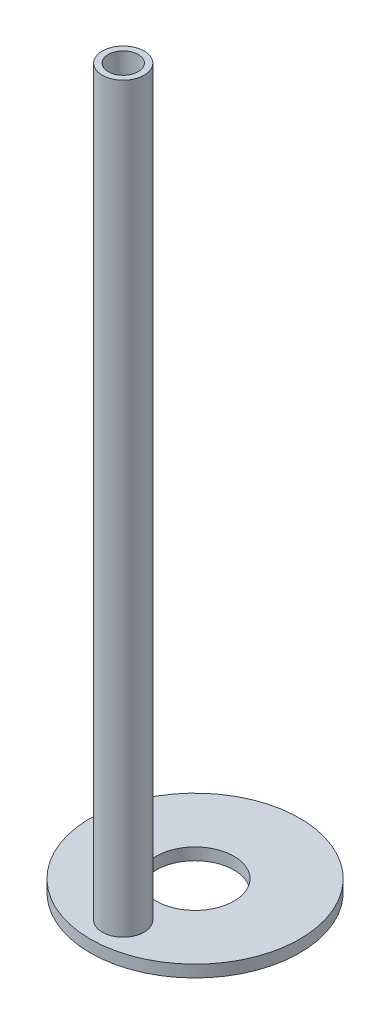
ISO-10303-21;
HEADER;
FILE_DESCRIPTION(('STEP AP214'),'2;1');
FILE_NAME('part.step','',(''),(''),'','','');
FILE_SCHEMA(('AUTOMOTIVE_DESIGN { 1 0 10303 214 1 1 1 1 }'));
ENDSEC;
DATA;
#1=APPLICATION_CONTEXT('core data for automotive mechanical design processes');
#2=APPLICATION_PROTOCOL_DEFINITION('international standard','automotive_design',2000,#1);
#3=PRODUCT_CONTEXT('',#1,'mechanical');
#4=PRODUCT('Part','Part','',(#3));
#5=PRODUCT_RELATED_PRODUCT_CATEGORY('part','',(#4));
#6=PRODUCT_DEFINITION_FORMATION('','',#4);
#7=PRODUCT_DEFINITION_CONTEXT('part definition',#1,'design');
#8=PRODUCT_DEFINITION('design','',#6,#7);
#9=PRODUCT_DEFINITION_SHAPE('','',#8);
#10=(LENGTH_UNIT() NAMED_UNIT(*) SI_UNIT(.MILLI.,.METRE.));
#11=(NAMED_UNIT(*) PLANE_ANGLE_UNIT() SI_UNIT($,.RADIAN.));
#12=(NAMED_UNIT(*) SI_UNIT($,.STERADIAN.) SOLID_ANGLE_UNIT());
#13=UNCERTAINTY_MEASURE_WITH_UNIT(LENGTH_MEASURE(1.E-05),#10,'distance_accuracy_value','');
#14=(GEOMETRIC_REPRESENTATION_CONTEXT(3) GLOBAL_UNCERTAINTY_ASSIGNED_CONTEXT((#13)) GLOBAL_UNIT_ASSIGNED_CONTEXT((#10,
#11,#12)) REPRESENTATION_CONTEXT('',''));
#15=CARTESIAN_POINT('',(0.,0.,0.));
#16=DIRECTION('',(0.,0.,1.));
#17=DIRECTION('',(1.,0.,0.));
#18=AXIS2_PLACEMENT_3D('',#15,#16,#17);
#19=CARTESIAN_POINT('',(0.,1.,0.));
#20=DIRECTION('',(0.,-1.,0.));
#21=DIRECTION('',(0.,0.,-1.));
#22=AXIS2_PLACEMENT_3D('',#19,#20,#21);
#23=CYLINDRICAL_SURFACE('',#22,6.5);
#24=CARTESIAN_POINT('',(0.,1.,0.));
#25=DIRECTION('',(0.,1.,0.));
#26=DIRECTION('',(0.,0.,1.));
#27=AXIS2_PLACEMENT_3D('',#24,#25,#26);
#28=CIRCLE('',#27,6.5);
#29=CARTESIAN_POINT('',(0.,1.,6.5));
#30=VERTEX_POINT('',#29);
#31=EDGE_CURVE('E53',#30,#30,#28,.T.);
#32=ORIENTED_EDGE('',*,*,#31,.T.);
#33=EDGE_LOOP('',(#32));
#34=FACE_BOUND('',#33,.T.);
#35=CARTESIAN_POINT('',(0.,-1.,0.));
#36=DIRECTION('',(0.,1.,0.));
#37=DIRECTION('',(0.,0.,1.));
#38=AXIS2_PLACEMENT_3D('',#35,#36,#37);
#39=CIRCLE('',#38,6.5);
#40=CARTESIAN_POINT('',(0.,-1.,6.5));
#41=VERTEX_POINT('',#40);
#42=EDGE_CURVE('E63',#41,#41,#39,.T.);
#43=ORIENTED_EDGE('',*,*,#42,.F.);
#44=EDGE_LOOP('',(#43));
#45=FACE_BOUND('',#44,.T.);
#46=ADVANCED_FACE('F45',(#34,#45),#23,.F.);
#47=CARTESIAN_POINT('',(0.,1.,0.));
#48=DIRECTION('',(0.,-1.,0.));
#49=DIRECTION('',(0.,0.,-1.));
#50=AXIS2_PLACEMENT_3D('',#47,#48,#49);
#51=CYLINDRICAL_SURFACE('',#50,17.5);
#52=CARTESIAN_POINT('',(0.,1.,0.));
#53=DIRECTION('',(0.,1.,0.));
#54=DIRECTION('',(0.,0.,1.));
#55=AXIS2_PLACEMENT_3D('',#52,#53,#54);
#56=CIRCLE('',#55,17.5);
#57=CARTESIAN_POINT('',(0.,1.,17.5));
#58=VERTEX_POINT('',#57);
#59=EDGE_CURVE('E10',#58,#58,#56,.T.);
#60=ORIENTED_EDGE('',*,*,#59,.F.);
#61=EDGE_LOOP('',(#60));
#62=FACE_BOUND('',#61,.T.);
#63=CARTESIAN_POINT('',(0.,-1.,0.));
#64=DIRECTION('',(0.,1.,0.));
#65=DIRECTION('',(0.,0.,1.));
#66=AXIS2_PLACEMENT_3D('',#63,#64,#65);
#67=CIRCLE('',#66,17.5);
#68=CARTESIAN_POINT('',(0.,-1.,17.5));
#69=VERTEX_POINT('',#68);
#70=EDGE_CURVE('E59',#69,#69,#67,.T.);
#71=ORIENTED_EDGE('',*,*,#70,.T.);
#72=EDGE_LOOP('',(#71));
#73=FACE_BOUND('',#72,.T.);
#74=ADVANCED_FACE('F70',(#62,#73),#51,.T.);
#75=CARTESIAN_POINT('',(0.,1.,0.));
#76=DIRECTION('',(0.,1.,0.));
#77=DIRECTION('',(0.,0.,1.));
#78=AXIS2_PLACEMENT_3D('',#75,#76,#77);
#79=PLANE('',#78);
#80=CARTESIAN_POINT('',(0.,1.,12.));
#81=DIRECTION('',(0.,1.,0.));
#82=DIRECTION('',(0.,0.,1.));
#83=AXIS2_PLACEMENT_3D('',#80,#81,#82);
#84=CIRCLE('',#83,3.5);
#85=CARTESIAN_POINT('',(0.,1.,15.5));
#86=VERTEX_POINT('',#85);
#87=EDGE_CURVE('E48',#86,#86,#84,.F.);
#88=ORIENTED_EDGE('',*,*,#87,.T.);
#89=EDGE_LOOP('',(#88));
#90=FACE_BOUND('',#89,.T.);
#91=ORIENTED_EDGE('',*,*,#31,.F.);
#92=EDGE_LOOP('',(#91));
#93=FACE_BOUND('',#92,.T.);
#94=ORIENTED_EDGE('',*,*,#59,.T.);
#95=EDGE_LOOP('',(#94));
#96=FACE_BOUND('',#95,.T.);
#97=ADVANCED_FACE('F75',(#90,#93,#96),#79,.T.);
#98=CARTESIAN_POINT('',(0.,-1.,0.));
#99=DIRECTION('',(0.,1.,0.));
#100=DIRECTION('',(0.,0.,1.));
#101=AXIS2_PLACEMENT_3D('',#98,#99,#100);
#102=PLANE('',#101);
#103=CARTESIAN_POINT('',(0.,-1.,12.));
#104=DIRECTION('',(0.,1.,0.));
#105=DIRECTION('',(0.,0.,1.));
#106=AXIS2_PLACEMENT_3D('',#103,#104,#105);
#107=CIRCLE('',#106,2.5);
#108=CARTESIAN_POINT('',(0.,-1.,14.5));
#109=VERTEX_POINT('',#108);
#110=EDGE_CURVE('E139',#109,#109,#107,.T.);
#111=ORIENTED_EDGE('',*,*,#110,.T.);
#112=EDGE_LOOP('',(#111));
#113=FACE_BOUND('',#112,.T.);
#114=ORIENTED_EDGE('',*,*,#42,.T.);
#115=EDGE_LOOP('',(#114));
#116=FACE_BOUND('',#115,.T.);
#117=ORIENTED_EDGE('',*,*,#70,.F.);
#118=EDGE_LOOP('',(#117));
#119=FACE_BOUND('',#118,.T.);
#120=ADVANCED_FACE('F72',(#113,#116,#119),#102,.F.);
#121=CARTESIAN_POINT('',(0.,125.,12.));
#122=DIRECTION('',(0.,-1.,0.));
#123=DIRECTION('',(0.,0.,-1.));
#124=AXIS2_PLACEMENT_3D('',#121,#122,#123);
#125=CYLINDRICAL_SURFACE('',#124,3.5);
#126=ORIENTED_EDGE('',*,*,#87,.F.);
#127=EDGE_LOOP('',(#126));
#128=FACE_BOUND('',#127,.T.);
#129=CARTESIAN_POINT('',(0.,125.,12.));
#130=DIRECTION('',(0.,1.,0.));
#131=DIRECTION('',(0.,0.,1.));
#132=AXIS2_PLACEMENT_3D('',#129,#130,#131);
#133=CIRCLE('',#132,3.5);
#134=CARTESIAN_POINT('',(0.,125.,15.5));
#135=VERTEX_POINT('',#134);
#136=EDGE_CURVE('E146',#135,#135,#133,.T.);
#137=ORIENTED_EDGE('',*,*,#136,.F.);
#138=EDGE_LOOP('',(#137));
#139=FACE_BOUND('',#138,.T.);
#140=ADVANCED_FACE('F74',(#128,#139),#125,.T.);
#141=CARTESIAN_POINT('',(0.,125.,12.));
#142=DIRECTION('',(0.,1.,0.));
#143=DIRECTION('',(0.,0.,1.));
#144=AXIS2_PLACEMENT_3D('',#141,#142,#143);
#145=PLANE('',#144);
#146=CARTESIAN_POINT('',(0.,125.,12.));
#147=DIRECTION('',(0.,1.,0.));
#148=DIRECTION('',(0.,0.,1.));
#149=AXIS2_PLACEMENT_3D('',#146,#147,#148);
#150=CIRCLE('',#149,2.5);
#151=CARTESIAN_POINT('',(0.,125.,14.5));
#152=VERTEX_POINT('',#151);
#153=EDGE_CURVE('E142',#152,#152,#150,.T.);
#154=ORIENTED_EDGE('',*,*,#153,.F.);
#155=EDGE_LOOP('',(#154));
#156=FACE_BOUND('',#155,.T.);
#157=ORIENTED_EDGE('',*,*,#136,.T.);
#158=EDGE_LOOP('',(#157));
#159=FACE_BOUND('',#158,.T.);
#160=ADVANCED_FACE('F82',(#156,#159),#145,.T.);
#161=CARTESIAN_POINT('',(0.,-1.,12.));
#162=DIRECTION('',(0.,1.,0.));
#163=DIRECTION('',(0.,0.,1.));
#164=AXIS2_PLACEMENT_3D('',#161,#162,#163);
#165=CYLINDRICAL_SURFACE('',#164,2.5);
#166=ORIENTED_EDGE('',*,*,#110,.F.);
#167=EDGE_LOOP('',(#166));
#168=FACE_BOUND('',#167,.T.);
#169=ORIENTED_EDGE('',*,*,#153,.T.);
#170=EDGE_LOOP('',(#169));
#171=FACE_BOUND('',#170,.T.);
#172=ADVANCED_FACE('F124',(#168,#171),#165,.F.);
#173=CLOSED_SHELL('',(#46,#74,#97,#120,#140,#160,#172));
#174=MANIFOLD_SOLID_BREP('B2',#173);
#175=ADVANCED_BREP_SHAPE_REPRESENTATION('',(#18,#174),#14);
#176=SHAPE_DEFINITION_REPRESENTATION(#9,#175);
ENDSEC;
END-ISO-10303-21;
